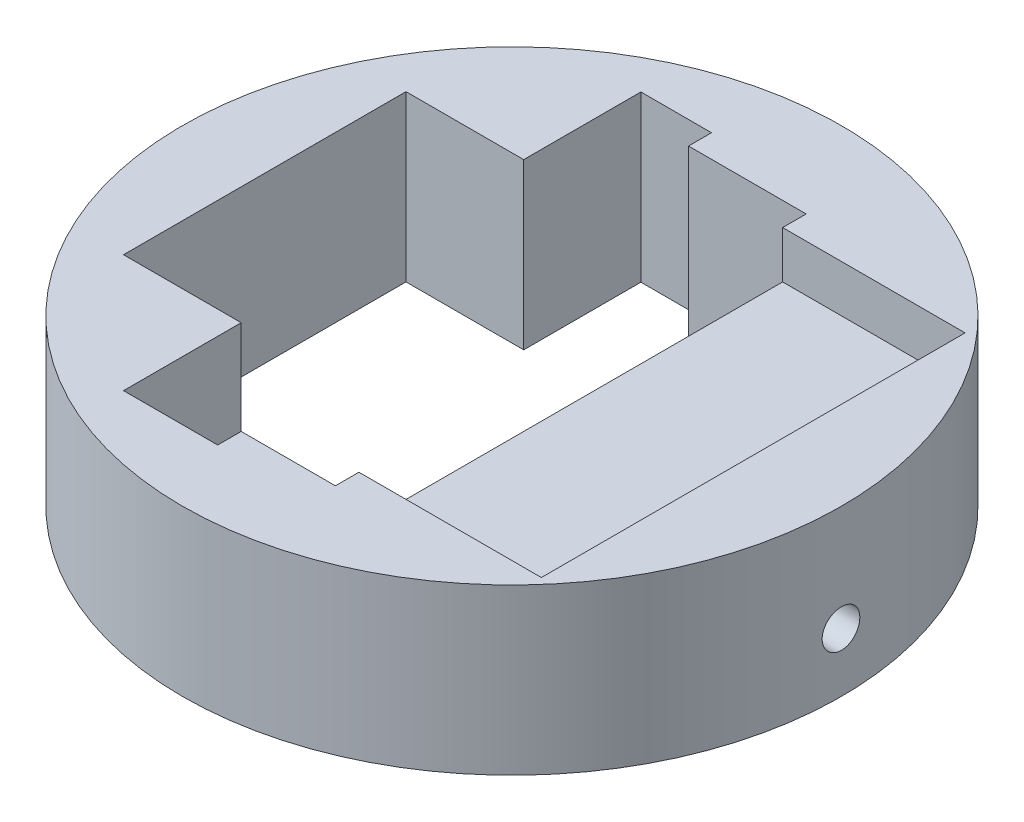
ISO-10303-21;
HEADER;
FILE_DESCRIPTION(('STEP AP214'),'2;1');
FILE_NAME('part.step','',(''),(''),'','','');
FILE_SCHEMA(('AUTOMOTIVE_DESIGN { 1 0 10303 214 1 1 1 1 }'));
ENDSEC;
DATA;
#1=APPLICATION_CONTEXT('core data for automotive mechanical design processes');
#2=APPLICATION_PROTOCOL_DEFINITION('international standard','automotive_design',2000,#1);
#3=PRODUCT_CONTEXT('',#1,'mechanical');
#4=PRODUCT('Part','Part','',(#3));
#5=PRODUCT_RELATED_PRODUCT_CATEGORY('part','',(#4));
#6=PRODUCT_DEFINITION_FORMATION('','',#4);
#7=PRODUCT_DEFINITION_CONTEXT('part definition',#1,'design');
#8=PRODUCT_DEFINITION('design','',#6,#7);
#9=PRODUCT_DEFINITION_SHAPE('','',#8);
#10=(LENGTH_UNIT() NAMED_UNIT(*) SI_UNIT(.MILLI.,.METRE.));
#11=(NAMED_UNIT(*) PLANE_ANGLE_UNIT() SI_UNIT($,.RADIAN.));
#12=(NAMED_UNIT(*) SI_UNIT($,.STERADIAN.) SOLID_ANGLE_UNIT());
#13=UNCERTAINTY_MEASURE_WITH_UNIT(LENGTH_MEASURE(1.E-05),#10,'distance_accuracy_value','');
#14=(GEOMETRIC_REPRESENTATION_CONTEXT(3) GLOBAL_UNCERTAINTY_ASSIGNED_CONTEXT((#13)) GLOBAL_UNIT_ASSIGNED_CONTEXT((#10,
#11,#12)) REPRESENTATION_CONTEXT('',''));
#15=CARTESIAN_POINT('',(0.,0.,0.));
#16=DIRECTION('',(0.,0.,1.));
#17=DIRECTION('',(1.,0.,0.));
#18=AXIS2_PLACEMENT_3D('',#15,#16,#17);
#19=CARTESIAN_POINT('',(0.,7.,0.));
#20=DIRECTION('',(0.,-1.,0.));
#21=DIRECTION('',(0.,0.,-1.));
#22=AXIS2_PLACEMENT_3D('',#19,#20,#21);
#23=CYLINDRICAL_SURFACE('',#22,14.);
#24=CARTESIAN_POINT('',(13.9771241677249,2.5,-0.8));
#25=CARTESIAN_POINT('',(13.9771244743379,2.45510302465943,-0.799998021692271));
#26=CARTESIAN_POINT('',(13.9773428189584,2.41017442873324,-0.796207792688452));
#27=CARTESIAN_POINT('',(13.9781927308026,2.3215572958776,-0.781141927639512));
#28=CARTESIAN_POINT('',(13.9788247816795,2.27787027289035,-0.769857530128635));
#29=CARTESIAN_POINT('',(13.9804302796029,2.1930327775627,-0.740128039150316));
#30=CARTESIAN_POINT('',(13.9814035492303,2.1518810000528,-0.721686666469071));
#31=CARTESIAN_POINT('',(13.9835815940789,2.07326800516524,-0.678172589252471));
#32=CARTESIAN_POINT('',(13.984786315527,2.03580593361201,-0.653101424505277));
#33=CARTESIAN_POINT('',(13.9872932684381,1.96557689336275,-0.597004068657194));
#34=CARTESIAN_POINT('',(13.9885956080889,1.93281525477298,-0.565971209015206));
#35=CARTESIAN_POINT('',(13.9911500395831,1.87296261064955,-0.498844969154513));
#36=CARTESIAN_POINT('',(13.9924021293495,1.84587183932443,-0.462751380028906));
#37=CARTESIAN_POINT('',(13.9947158651488,1.79811428127445,-0.386499089336457));
#38=CARTESIAN_POINT('',(13.9957773835497,1.77745179304547,-0.346337691373904));
#39=CARTESIAN_POINT('',(13.9975892418334,1.74316488182172,-0.263108760186616));
#40=CARTESIAN_POINT('',(13.9983395846018,1.72954039355904,-0.220041253916278));
#41=CARTESIAN_POINT('',(13.9994438040274,1.70973071440032,-0.132272992202261));
#42=CARTESIAN_POINT('',(13.9997981170164,1.70353733561141,-0.087574090377647));
#43=CARTESIAN_POINT('',(14.0000718187461,1.69874040454522,0.00223019544865451));
#44=CARTESIAN_POINT('',(13.999991211715,1.70013677848075,0.0473355754943249));
#45=CARTESIAN_POINT('',(13.9994045220293,1.71047294338269,0.136616990257277));
#46=CARTESIAN_POINT('',(13.9988989362861,1.71940392446052,0.180794048618258));
#47=CARTESIAN_POINT('',(13.9975197945313,1.74454212108032,0.267020923206767));
#48=CARTESIAN_POINT('',(13.996646236631,1.76074937396427,0.309070728515957));
#49=CARTESIAN_POINT('',(13.9946286715729,1.79999005735905,0.389877779004846));
#50=CARTESIAN_POINT('',(13.9934845059263,1.823027490159,0.428633076517221));
#51=CARTESIAN_POINT('',(13.9910545304804,1.87527166896045,0.501729713394125));
#52=CARTESIAN_POINT('',(13.9897687193576,1.90447847260603,0.536071011511226));
#53=CARTESIAN_POINT('',(13.987198034341,1.96828209735191,0.599416228139994));
#54=CARTESIAN_POINT('',(13.9859131644143,2.00288656355519,0.628412446941761));
#55=CARTESIAN_POINT('',(13.9834910578935,2.07647640218527,0.6801850661041));
#56=CARTESIAN_POINT('',(13.9823538213484,2.11546177606919,0.702961464395896));
#57=CARTESIAN_POINT('',(13.9803553735595,2.19671156057994,0.741647299659374));
#58=CARTESIAN_POINT('',(13.979494174715,2.2389761184002,0.757556428167799));
#59=CARTESIAN_POINT('',(13.978145377356,2.32558235792233,0.782050885226867));
#60=CARTESIAN_POINT('',(13.9776577751701,2.36992401920848,0.790636285745998));
#61=CARTESIAN_POINT('',(13.9771118429597,2.45935864688665,0.800230017849172));
#62=CARTESIAN_POINT('',(13.9770529069843,2.50445046240984,0.8012490450961));
#63=CARTESIAN_POINT('',(13.97736937101,2.59416441038649,0.79570903414815));
#64=CARTESIAN_POINT('',(13.9777447691271,2.6387865448766,0.789150028827261));
#65=CARTESIAN_POINT('',(13.978887040407,2.72626431891299,0.768649017165485));
#66=CARTESIAN_POINT('',(13.9796536531,2.76912111332669,0.754711922906852));
#67=CARTESIAN_POINT('',(13.9814917351046,2.85188727449899,0.719855329628873));
#68=CARTESIAN_POINT('',(13.9825632067261,2.89179661892156,0.69893577770247));
#69=CARTESIAN_POINT('',(13.9848917244275,2.96758416564593,0.650680712140984));
#70=CARTESIAN_POINT('',(13.986148977444,3.00345779317197,0.623338023669904));
#71=CARTESIAN_POINT('',(13.9887066397301,3.07010953130303,0.563023304012391));
#72=CARTESIAN_POINT('',(13.9900070493554,3.10088759991509,0.53005122643821));
#73=CARTESIAN_POINT('',(13.992506243677,3.15651058730901,0.459367694647848));
#74=CARTESIAN_POINT('',(13.9937049088842,3.18134859057582,0.421650793609244));
#75=CARTESIAN_POINT('',(13.9958638239064,3.22433908700389,0.34257571280156));
#76=CARTESIAN_POINT('',(13.9968240749955,3.24249161589185,0.301217552492577));
#77=CARTESIAN_POINT('',(13.9983973821016,3.27158382151925,0.216059520846397));
#78=CARTESIAN_POINT('',(13.9990106498015,3.28252789656211,0.172261156150845));
#79=CARTESIAN_POINT('',(13.9998217253799,3.29690693064926,0.0834449771201405));
#80=CARTESIAN_POINT('',(14.000019536551,3.30034194920375,0.0384271724520609));
#81=CARTESIAN_POINT('',(13.9999774203995,3.29960479661445,-0.0514814660033658));
#82=CARTESIAN_POINT('',(13.9997381164755,3.29544345913994,-0.0963723893098683));
#83=CARTESIAN_POINT('',(13.9988499280013,3.27965415187652,-0.184817076656193));
#84=CARTESIAN_POINT('',(13.9982010427057,3.268026168498,-0.228370838262177));
#85=CARTESIAN_POINT('',(13.9965666569387,3.23763599714559,-0.312906764220562));
#86=CARTESIAN_POINT('',(13.9955811563998,3.21887380774221,-0.353888928057685));
#87=CARTESIAN_POINT('',(13.9933842728574,3.17474945527508,-0.432122649960499));
#88=CARTESIAN_POINT('',(13.992172896202,3.14938747768431,-0.469374312823235));
#89=CARTESIAN_POINT('',(13.9896585364474,3.0927438844043,-0.539144245777155));
#90=CARTESIAN_POINT('',(13.9883554351211,3.06145453754417,-0.571656234714201));
#91=CARTESIAN_POINT('',(13.9858053881471,2.99385288901703,-0.630976807993079));
#92=CARTESIAN_POINT('',(13.984558456354,2.95753935700353,-0.657783991221041));
#93=CARTESIAN_POINT('',(13.9822603594601,2.8808845668857,-0.704950512737781));
#94=CARTESIAN_POINT('',(13.9812094136072,2.84053887458843,-0.725302647438153));
#95=CARTESIAN_POINT('',(13.9794251418201,2.75702680367127,-0.758919461317532));
#96=CARTESIAN_POINT('',(13.9786914426304,2.71386380896594,-0.772192473731904));
#97=CARTESIAN_POINT('',(13.9778177733066,2.64202904603279,-0.787809986450049));
#98=CARTESIAN_POINT('',(13.9775588265759,2.61382206100608,-0.792375364590585));
#99=CARTESIAN_POINT('',(13.9772119264058,2.55708097826925,-0.798470998565349));
#100=CARTESIAN_POINT('',(13.9771239727709,2.52854688093308,-0.800001257869039));
#101=CARTESIAN_POINT('',(13.9771241677249,2.5,-0.8));
#102=B_SPLINE_CURVE_WITH_KNOTS('',3,(#24,#25,#26,#27,#28,#29,#30,#31,#32,#33,#34,#35,#36,#37,
#38,#39,#40,#41,#42,#43,#44,#45,#46,#47,#48,#49,#50,#51,#52,#53,#54,#55,#56,#57,#58,#59,#60,#61,
#62,#63,#64,#65,#66,#67,#68,#69,#70,#71,#72,#73,#74,#75,#76,#77,#78,#79,#80,#81,#82,#83,#84,#85,
#86,#87,#88,#89,#90,#91,#92,#93,#94,#95,#96,#97,#98,#99,#100,#101),.UNSPECIFIED.,.T.,.F.,(4,2,2,
2,2,2,2,2,2,2,2,2,2,2,2,2,2,2,2,2,2,2,2,2,2,2,2,2,2,2,2,2,2,2,2,2,2,2,4),(0.,0.134586715237445,
0.269331054045677,0.404005435266397,0.538648565406722,0.673443188862089,0.808243378278339,
0.943133513762434,1.07802239830123,1.21276251999767,1.34750133175979,1.48208281728607,
1.61666499349512,1.75132618738098,1.88598863954166,2.02084358549235,2.15569857629709,
2.29055962387305,2.42541934618712,2.56008839733374,2.69475686427961,2.82933578605909,
2.96391572758501,3.09864671983372,3.23337882235727,3.36826702667495,3.50315451014905,
3.63795961437256,3.77276365024519,3.90737558328355,4.04198776132165,4.17659996633228,
4.31120838876229,4.44599360746087,4.58081189162265,4.71578010276107,4.85058908254449,
4.9361635627354,5.02173794510557),.UNSPECIFIED.);
#103=CARTESIAN_POINT('',(13.9771241677249,2.5,-0.8));
#104=VERTEX_POINT('',#103);
#105=EDGE_CURVE('E171',#104,#104,#102,.T.);
#106=ORIENTED_EDGE('',*,*,#105,.T.);
#107=EDGE_LOOP('',(#106));
#108=FACE_BOUND('',#107,.T.);
#109=CARTESIAN_POINT('',(0.,7.,0.));
#110=DIRECTION('',(0.,1.,0.));
#111=DIRECTION('',(0.,0.,1.));
#112=AXIS2_PLACEMENT_3D('',#109,#110,#111);
#113=CIRCLE('',#112,14.);
#114=CARTESIAN_POINT('',(0.,7.,14.));
#115=VERTEX_POINT('',#114);
#116=EDGE_CURVE('E279',#115,#115,#113,.T.);
#117=ORIENTED_EDGE('',*,*,#116,.F.);
#118=EDGE_LOOP('',(#117));
#119=FACE_BOUND('',#118,.T.);
#120=CARTESIAN_POINT('',(0.,0.,0.));
#121=DIRECTION('',(0.,1.,0.));
#122=DIRECTION('',(0.,0.,1.));
#123=AXIS2_PLACEMENT_3D('',#120,#121,#122);
#124=CIRCLE('',#123,14.);
#125=CARTESIAN_POINT('',(0.,0.,14.));
#126=VERTEX_POINT('',#125);
#127=EDGE_CURVE('E256',#126,#126,#124,.T.);
#128=ORIENTED_EDGE('',*,*,#127,.T.);
#129=EDGE_LOOP('',(#128));
#130=FACE_BOUND('',#129,.T.);
#131=ADVANCED_FACE('F34',(#108,#119,#130),#23,.T.);
#132=CARTESIAN_POINT('',(0.,7.,0.));
#133=DIRECTION('',(0.,1.,0.));
#134=DIRECTION('',(0.,0.,1.));
#135=AXIS2_PLACEMENT_3D('',#132,#133,#134);
#136=PLANE('',#135);
#137=DIRECTION('',(1.,0.,0.));
#138=VECTOR('',#137,1.);
#139=CARTESIAN_POINT('',(-1.75,7.,9.));
#140=LINE('',#139,#138);
#141=CARTESIAN_POINT('',(2.50000000000001,7.,9.));
#142=VERTEX_POINT('',#141);
#143=CARTESIAN_POINT('',(10.25,7.,9.));
#144=VERTEX_POINT('',#143);
#145=EDGE_CURVE('E166',#142,#144,#140,.T.);
#146=ORIENTED_EDGE('',*,*,#145,.F.);
#147=DIRECTION('',(0.,0.,-1.));
#148=VECTOR('',#147,1.);
#149=CARTESIAN_POINT('',(2.50000000000001,7.,10.));
#150=LINE('',#149,#148);
#151=CARTESIAN_POINT('',(2.50000000000001,7.,10.));
#152=VERTEX_POINT('',#151);
#153=EDGE_CURVE('E243',#152,#142,#150,.T.);
#154=ORIENTED_EDGE('',*,*,#153,.F.);
#155=DIRECTION('',(1.,0.,0.));
#156=VECTOR('',#155,1.);
#157=CARTESIAN_POINT('',(2.50000000000001,7.,10.));
#158=LINE('',#157,#156);
#159=CARTESIAN_POINT('',(-1.5,7.,10.));
#160=VERTEX_POINT('',#159);
#161=EDGE_CURVE('E239',#160,#152,#158,.T.);
#162=ORIENTED_EDGE('',*,*,#161,.F.);
#163=DIRECTION('',(0.,0.,-1.));
#164=VECTOR('',#163,1.);
#165=CARTESIAN_POINT('',(-1.5,7.,11.));
#166=LINE('',#165,#164);
#167=CARTESIAN_POINT('',(-1.5,7.,11.));
#168=VERTEX_POINT('',#167);
#169=EDGE_CURVE('E236',#168,#160,#166,.T.);
#170=ORIENTED_EDGE('',*,*,#169,.F.);
#171=DIRECTION('',(1.,0.,0.));
#172=VECTOR('',#171,1.);
#173=CARTESIAN_POINT('',(-5.5,7.,11.));
#174=LINE('',#173,#172);
#175=CARTESIAN_POINT('',(-5.5,7.,11.));
#176=VERTEX_POINT('',#175);
#177=EDGE_CURVE('E233',#176,#168,#174,.T.);
#178=ORIENTED_EDGE('',*,*,#177,.F.);
#179=DIRECTION('',(0.,0.,1.));
#180=VECTOR('',#179,1.);
#181=CARTESIAN_POINT('',(-5.5,7.,11.));
#182=LINE('',#181,#180);
#183=CARTESIAN_POINT('',(-5.5,7.,6.));
#184=VERTEX_POINT('',#183);
#185=EDGE_CURVE('E230',#184,#176,#182,.T.);
#186=ORIENTED_EDGE('',*,*,#185,.F.);
#187=DIRECTION('',(1.,0.,0.));
#188=VECTOR('',#187,1.);
#189=CARTESIAN_POINT('',(-5.5,7.,6.));
#190=LINE('',#189,#188);
#191=CARTESIAN_POINT('',(-10.5,7.,6.));
#192=VERTEX_POINT('',#191);
#193=EDGE_CURVE('E227',#192,#184,#190,.T.);
#194=ORIENTED_EDGE('',*,*,#193,.F.);
#195=DIRECTION('',(0.,0.,1.));
#196=VECTOR('',#195,1.);
#197=CARTESIAN_POINT('',(-10.5,7.,-6.));
#198=LINE('',#197,#196);
#199=CARTESIAN_POINT('',(-10.5,7.,-6.));
#200=VERTEX_POINT('',#199);
#201=EDGE_CURVE('E224',#200,#192,#198,.T.);
#202=ORIENTED_EDGE('',*,*,#201,.F.);
#203=DIRECTION('',(-1.,0.,0.));
#204=VECTOR('',#203,1.);
#205=CARTESIAN_POINT('',(-5.5,7.,-6.));
#206=LINE('',#205,#204);
#207=CARTESIAN_POINT('',(-5.5,7.,-6.));
#208=VERTEX_POINT('',#207);
#209=EDGE_CURVE('E221',#208,#200,#206,.T.);
#210=ORIENTED_EDGE('',*,*,#209,.F.);
#211=DIRECTION('',(0.,0.,1.));
#212=VECTOR('',#211,1.);
#213=CARTESIAN_POINT('',(-5.5,7.,-10.9772609758359));
#214=LINE('',#213,#212);
#215=CARTESIAN_POINT('',(-5.5,7.,-10.9772609758359));
#216=VERTEX_POINT('',#215);
#217=EDGE_CURVE('E57',#216,#208,#214,.T.);
#218=ORIENTED_EDGE('',*,*,#217,.F.);
#219=DIRECTION('',(-1.,0.,0.));
#220=VECTOR('',#219,1.);
#221=CARTESIAN_POINT('',(-5.5,7.,-10.9772609758359));
#222=LINE('',#221,#220);
#223=CARTESIAN_POINT('',(-2.5,7.,-10.9772609758359));
#224=VERTEX_POINT('',#223);
#225=EDGE_CURVE('E186',#224,#216,#222,.T.);
#226=ORIENTED_EDGE('',*,*,#225,.F.);
#227=DIRECTION('',(0.,0.,-1.));
#228=VECTOR('',#227,1.);
#229=CARTESIAN_POINT('',(-2.5,7.,-10.9772609758359));
#230=LINE('',#229,#228);
#231=CARTESIAN_POINT('',(-2.49999999999999,7.,-10.));
#232=VERTEX_POINT('',#231);
#233=EDGE_CURVE('E249',#232,#224,#230,.T.);
#234=ORIENTED_EDGE('',*,*,#233,.F.);
#235=DIRECTION('',(-1.,0.,0.));
#236=VECTOR('',#235,1.);
#237=CARTESIAN_POINT('',(2.50000000000001,7.,-10.));
#238=LINE('',#237,#236);
#239=CARTESIAN_POINT('',(2.50000000000001,7.,-10.));
#240=VERTEX_POINT('',#239);
#241=EDGE_CURVE('E246',#240,#232,#238,.T.);
#242=ORIENTED_EDGE('',*,*,#241,.F.);
#243=CARTESIAN_POINT('',(2.50000000000001,7.,-9.));
#244=VERTEX_POINT('',#243);
#245=EDGE_CURVE('E242',#244,#240,#150,.T.);
#246=ORIENTED_EDGE('',*,*,#245,.F.);
#247=DIRECTION('',(-1.,0.,0.));
#248=VECTOR('',#247,1.);
#249=CARTESIAN_POINT('',(-1.75,7.,-9.));
#250=LINE('',#249,#248);
#251=CARTESIAN_POINT('',(10.25,7.,-9.));
#252=VERTEX_POINT('',#251);
#253=EDGE_CURVE('E168',#252,#244,#250,.T.);
#254=ORIENTED_EDGE('',*,*,#253,.F.);
#255=DIRECTION('',(0.,0.,-1.));
#256=VECTOR('',#255,1.);
#257=CARTESIAN_POINT('',(10.25,7.,9.));
#258=LINE('',#257,#256);
#259=EDGE_CURVE('E153',#144,#252,#258,.T.);
#260=ORIENTED_EDGE('',*,*,#259,.F.);
#261=EDGE_LOOP('',(#146,#154,#162,#170,#178,#186,#194,#202,#210,#218,#226,#234,#242,#246,#254,#260));
#262=FACE_BOUND('',#261,.T.);
#263=ORIENTED_EDGE('',*,*,#116,.T.);
#264=EDGE_LOOP('',(#263));
#265=FACE_BOUND('',#264,.T.);
#266=ADVANCED_FACE('F291',(#262,#265),#136,.T.);
#267=CARTESIAN_POINT('',(0.,0.,0.));
#268=DIRECTION('',(0.,1.,0.));
#269=DIRECTION('',(0.,0.,1.));
#270=AXIS2_PLACEMENT_3D('',#267,#268,#269);
#271=PLANE('',#270);
#272=DIRECTION('',(-1.,0.,0.));
#273=VECTOR('',#272,1.);
#274=CARTESIAN_POINT('',(-5.5,0.,-10.9772609758359));
#275=LINE('',#274,#273);
#276=CARTESIAN_POINT('',(-2.5,0.,-10.9772609758359));
#277=VERTEX_POINT('',#276);
#278=CARTESIAN_POINT('',(-5.5,0.,-10.9772609758359));
#279=VERTEX_POINT('',#278);
#280=EDGE_CURVE('E216',#277,#279,#275,.T.);
#281=ORIENTED_EDGE('',*,*,#280,.T.);
#282=DIRECTION('',(0.,0.,1.));
#283=VECTOR('',#282,1.);
#284=CARTESIAN_POINT('',(-5.5,0.,-10.9772609758359));
#285=LINE('',#284,#283);
#286=CARTESIAN_POINT('',(-5.5,0.,-6.));
#287=VERTEX_POINT('',#286);
#288=EDGE_CURVE('E182',#279,#287,#285,.T.);
#289=ORIENTED_EDGE('',*,*,#288,.T.);
#290=DIRECTION('',(-1.,0.,0.));
#291=VECTOR('',#290,1.);
#292=CARTESIAN_POINT('',(-5.5,0.,-6.));
#293=LINE('',#292,#291);
#294=CARTESIAN_POINT('',(-10.5,0.,-6.));
#295=VERTEX_POINT('',#294);
#296=EDGE_CURVE('E185',#287,#295,#293,.T.);
#297=ORIENTED_EDGE('',*,*,#296,.T.);
#298=DIRECTION('',(0.,0.,1.));
#299=VECTOR('',#298,1.);
#300=CARTESIAN_POINT('',(-10.5,0.,-6.));
#301=LINE('',#300,#299);
#302=CARTESIAN_POINT('',(-10.5,0.,6.));
#303=VERTEX_POINT('',#302);
#304=EDGE_CURVE('E189',#295,#303,#301,.T.);
#305=ORIENTED_EDGE('',*,*,#304,.T.);
#306=DIRECTION('',(1.,0.,0.));
#307=VECTOR('',#306,1.);
#308=CARTESIAN_POINT('',(-5.5,0.,6.));
#309=LINE('',#308,#307);
#310=CARTESIAN_POINT('',(-5.5,0.,6.));
#311=VERTEX_POINT('',#310);
#312=EDGE_CURVE('E192',#303,#311,#309,.T.);
#313=ORIENTED_EDGE('',*,*,#312,.T.);
#314=DIRECTION('',(0.,0.,1.));
#315=VECTOR('',#314,1.);
#316=CARTESIAN_POINT('',(-5.5,0.,11.));
#317=LINE('',#316,#315);
#318=CARTESIAN_POINT('',(-5.5,0.,11.));
#319=VERTEX_POINT('',#318);
#320=EDGE_CURVE('E195',#311,#319,#317,.T.);
#321=ORIENTED_EDGE('',*,*,#320,.T.);
#322=DIRECTION('',(1.,0.,0.));
#323=VECTOR('',#322,1.);
#324=CARTESIAN_POINT('',(-5.5,0.,11.));
#325=LINE('',#324,#323);
#326=CARTESIAN_POINT('',(-1.5,0.,11.));
#327=VERTEX_POINT('',#326);
#328=EDGE_CURVE('E198',#319,#327,#325,.T.);
#329=ORIENTED_EDGE('',*,*,#328,.T.);
#330=DIRECTION('',(0.,0.,-1.));
#331=VECTOR('',#330,1.);
#332=CARTESIAN_POINT('',(-1.5,0.,11.));
#333=LINE('',#332,#331);
#334=CARTESIAN_POINT('',(-1.5,0.,10.));
#335=VERTEX_POINT('',#334);
#336=EDGE_CURVE('E201',#327,#335,#333,.T.);
#337=ORIENTED_EDGE('',*,*,#336,.T.);
#338=DIRECTION('',(1.,0.,0.));
#339=VECTOR('',#338,1.);
#340=CARTESIAN_POINT('',(2.50000000000001,0.,10.));
#341=LINE('',#340,#339);
#342=CARTESIAN_POINT('',(2.50000000000001,0.,10.));
#343=VERTEX_POINT('',#342);
#344=EDGE_CURVE('E204',#335,#343,#341,.T.);
#345=ORIENTED_EDGE('',*,*,#344,.T.);
#346=DIRECTION('',(0.,0.,-1.));
#347=VECTOR('',#346,1.);
#348=CARTESIAN_POINT('',(2.50000000000001,0.,10.));
#349=LINE('',#348,#347);
#350=CARTESIAN_POINT('',(2.50000000000001,0.,-10.));
#351=VERTEX_POINT('',#350);
#352=EDGE_CURVE('E207',#343,#351,#349,.T.);
#353=ORIENTED_EDGE('',*,*,#352,.T.);
#354=DIRECTION('',(-1.,0.,0.));
#355=VECTOR('',#354,1.);
#356=CARTESIAN_POINT('',(2.50000000000001,0.,-10.));
#357=LINE('',#356,#355);
#358=CARTESIAN_POINT('',(-2.49999999999999,0.,-10.));
#359=VERTEX_POINT('',#358);
#360=EDGE_CURVE('E210',#351,#359,#357,.T.);
#361=ORIENTED_EDGE('',*,*,#360,.T.);
#362=DIRECTION('',(0.,0.,-1.));
#363=VECTOR('',#362,1.);
#364=CARTESIAN_POINT('',(-2.5,0.,-10.9772609758359));
#365=LINE('',#364,#363);
#366=EDGE_CURVE('E213',#359,#277,#365,.T.);
#367=ORIENTED_EDGE('',*,*,#366,.T.);
#368=EDGE_LOOP('',(#281,#289,#297,#305,#313,#321,#329,#337,#345,#353,#361,#367));
#369=FACE_BOUND('',#368,.T.);
#370=ORIENTED_EDGE('',*,*,#127,.F.);
#371=EDGE_LOOP('',(#370));
#372=FACE_BOUND('',#371,.T.);
#373=ADVANCED_FACE('F302',(#369,#372),#271,.F.);
#374=CARTESIAN_POINT('',(-5.5,0.,-10.9772609758359));
#375=DIRECTION('',(-1.,0.,0.));
#376=DIRECTION('',(0.,0.,1.));
#377=AXIS2_PLACEMENT_3D('',#374,#375,#376);
#378=PLANE('',#377);
#379=ORIENTED_EDGE('',*,*,#217,.T.);
#380=DIRECTION('',(0.,1.,0.));
#381=VECTOR('',#380,1.);
#382=CARTESIAN_POINT('',(-5.5,0.,-6.));
#383=LINE('',#382,#381);
#384=EDGE_CURVE('E219',#287,#208,#383,.T.);
#385=ORIENTED_EDGE('',*,*,#384,.F.);
#386=ORIENTED_EDGE('',*,*,#288,.F.);
#387=DIRECTION('',(0.,1.,0.));
#388=VECTOR('',#387,1.);
#389=CARTESIAN_POINT('',(-5.5,0.,-10.9772609758359));
#390=LINE('',#389,#388);
#391=EDGE_CURVE('E254',#279,#216,#390,.T.);
#392=ORIENTED_EDGE('',*,*,#391,.T.);
#393=EDGE_LOOP('',(#379,#385,#386,#392));
#394=FACE_BOUND('',#393,.T.);
#395=ADVANCED_FACE('F337',(#394),#378,.F.);
#396=CARTESIAN_POINT('',(-5.5,0.,-10.9772609758359));
#397=DIRECTION('',(0.,0.,-1.));
#398=DIRECTION('',(-1.,0.,0.));
#399=AXIS2_PLACEMENT_3D('',#396,#397,#398);
#400=PLANE('',#399);
#401=ORIENTED_EDGE('',*,*,#225,.T.);
#402=ORIENTED_EDGE('',*,*,#391,.F.);
#403=ORIENTED_EDGE('',*,*,#280,.F.);
#404=DIRECTION('',(0.,1.,0.));
#405=VECTOR('',#404,1.);
#406=CARTESIAN_POINT('',(-2.5,0.,-10.9772609758359));
#407=LINE('',#406,#405);
#408=EDGE_CURVE('E257',#277,#224,#407,.T.);
#409=ORIENTED_EDGE('',*,*,#408,.T.);
#410=EDGE_LOOP('',(#401,#402,#403,#409));
#411=FACE_BOUND('',#410,.T.);
#412=ADVANCED_FACE('F341',(#411),#400,.F.);
#413=CARTESIAN_POINT('',(-2.5,0.,-10.9772609758359));
#414=DIRECTION('',(1.,0.,0.));
#415=DIRECTION('',(0.,0.,-1.));
#416=AXIS2_PLACEMENT_3D('',#413,#414,#415);
#417=PLANE('',#416);
#418=ORIENTED_EDGE('',*,*,#233,.T.);
#419=ORIENTED_EDGE('',*,*,#408,.F.);
#420=ORIENTED_EDGE('',*,*,#366,.F.);
#421=DIRECTION('',(0.,1.,0.));
#422=VECTOR('',#421,1.);
#423=CARTESIAN_POINT('',(-2.49999999999999,0.,-10.));
#424=LINE('',#423,#422);
#425=EDGE_CURVE('E259',#359,#232,#424,.T.);
#426=ORIENTED_EDGE('',*,*,#425,.T.);
#427=EDGE_LOOP('',(#418,#419,#420,#426));
#428=FACE_BOUND('',#427,.T.);
#429=ADVANCED_FACE('F370',(#428),#417,.F.);
#430=CARTESIAN_POINT('',(2.50000000000001,0.,-10.));
#431=DIRECTION('',(0.,0.,-1.));
#432=DIRECTION('',(-1.,0.,0.));
#433=AXIS2_PLACEMENT_3D('',#430,#431,#432);
#434=PLANE('',#433);
#435=ORIENTED_EDGE('',*,*,#241,.T.);
#436=ORIENTED_EDGE('',*,*,#425,.F.);
#437=ORIENTED_EDGE('',*,*,#360,.F.);
#438=DIRECTION('',(0.,1.,0.));
#439=VECTOR('',#438,1.);
#440=CARTESIAN_POINT('',(2.50000000000001,0.,-10.));
#441=LINE('',#440,#439);
#442=EDGE_CURVE('E261',#351,#240,#441,.T.);
#443=ORIENTED_EDGE('',*,*,#442,.T.);
#444=EDGE_LOOP('',(#435,#436,#437,#443));
#445=FACE_BOUND('',#444,.T.);
#446=ADVANCED_FACE('F296',(#445),#434,.F.);
#447=CARTESIAN_POINT('',(2.50000000000001,0.,10.));
#448=DIRECTION('',(1.,0.,0.));
#449=DIRECTION('',(0.,0.,-1.));
#450=AXIS2_PLACEMENT_3D('',#447,#448,#449);
#451=PLANE('',#450);
#452=CARTESIAN_POINT('',(2.50000000000001,2.5,0.));
#453=DIRECTION('',(1.,0.,0.));
#454=DIRECTION('',(0.,0.,-1.));
#455=AXIS2_PLACEMENT_3D('',#452,#453,#454);
#456=CIRCLE('',#455,0.8);
#457=CARTESIAN_POINT('',(2.50000000000001,2.5,-0.8));
#458=VERTEX_POINT('',#457);
#459=EDGE_CURVE('E500',#458,#458,#456,.F.);
#460=ORIENTED_EDGE('',*,*,#459,.F.);
#461=EDGE_LOOP('',(#460));
#462=FACE_BOUND('',#461,.T.);
#463=ORIENTED_EDGE('',*,*,#153,.T.);
#464=DIRECTION('',(0.,-1.,0.));
#465=VECTOR('',#464,1.);
#466=CARTESIAN_POINT('',(2.50000000000001,0.,9.));
#467=LINE('',#466,#465);
#468=CARTESIAN_POINT('',(2.50000000000001,5.,9.));
#469=VERTEX_POINT('',#468);
#470=EDGE_CURVE('E11',#142,#469,#467,.T.);
#471=ORIENTED_EDGE('',*,*,#470,.T.);
#472=DIRECTION('',(0.,0.,-1.));
#473=VECTOR('',#472,1.);
#474=CARTESIAN_POINT('',(2.50000000000001,5.,10.));
#475=LINE('',#474,#473);
#476=CARTESIAN_POINT('',(2.50000000000001,5.,-9.));
#477=VERTEX_POINT('',#476);
#478=EDGE_CURVE('E282',#469,#477,#475,.T.);
#479=ORIENTED_EDGE('',*,*,#478,.T.);
#480=DIRECTION('',(0.,1.,0.));
#481=VECTOR('',#480,1.);
#482=CARTESIAN_POINT('',(2.50000000000001,0.,-9.));
#483=LINE('',#482,#481);
#484=EDGE_CURVE('E42',#477,#244,#483,.T.);
#485=ORIENTED_EDGE('',*,*,#484,.T.);
#486=ORIENTED_EDGE('',*,*,#245,.T.);
#487=ORIENTED_EDGE('',*,*,#442,.F.);
#488=ORIENTED_EDGE('',*,*,#352,.F.);
#489=DIRECTION('',(0.,1.,0.));
#490=VECTOR('',#489,1.);
#491=CARTESIAN_POINT('',(2.50000000000001,0.,10.));
#492=LINE('',#491,#490);
#493=EDGE_CURVE('E264',#343,#152,#492,.T.);
#494=ORIENTED_EDGE('',*,*,#493,.T.);
#495=EDGE_LOOP('',(#463,#471,#479,#485,#486,#487,#488,#494));
#496=FACE_BOUND('',#495,.T.);
#497=ADVANCED_FACE('F287',(#462,#496),#451,.F.);
#498=CARTESIAN_POINT('',(2.50000000000001,0.,10.));
#499=DIRECTION('',(0.,0.,1.));
#500=DIRECTION('',(1.,0.,0.));
#501=AXIS2_PLACEMENT_3D('',#498,#499,#500);
#502=PLANE('',#501);
#503=ORIENTED_EDGE('',*,*,#161,.T.);
#504=ORIENTED_EDGE('',*,*,#493,.F.);
#505=ORIENTED_EDGE('',*,*,#344,.F.);
#506=DIRECTION('',(0.,1.,0.));
#507=VECTOR('',#506,1.);
#508=CARTESIAN_POINT('',(-1.5,0.,10.));
#509=LINE('',#508,#507);
#510=EDGE_CURVE('E266',#335,#160,#509,.T.);
#511=ORIENTED_EDGE('',*,*,#510,.T.);
#512=EDGE_LOOP('',(#503,#504,#505,#511));
#513=FACE_BOUND('',#512,.T.);
#514=ADVANCED_FACE('F306',(#513),#502,.F.);
#515=CARTESIAN_POINT('',(-1.5,0.,11.));
#516=DIRECTION('',(1.,0.,0.));
#517=DIRECTION('',(0.,0.,-1.));
#518=AXIS2_PLACEMENT_3D('',#515,#516,#517);
#519=PLANE('',#518);
#520=ORIENTED_EDGE('',*,*,#169,.T.);
#521=ORIENTED_EDGE('',*,*,#510,.F.);
#522=ORIENTED_EDGE('',*,*,#336,.F.);
#523=DIRECTION('',(0.,1.,0.));
#524=VECTOR('',#523,1.);
#525=CARTESIAN_POINT('',(-1.5,0.,11.));
#526=LINE('',#525,#524);
#527=EDGE_CURVE('E268',#327,#168,#526,.T.);
#528=ORIENTED_EDGE('',*,*,#527,.T.);
#529=EDGE_LOOP('',(#520,#521,#522,#528));
#530=FACE_BOUND('',#529,.T.);
#531=ADVANCED_FACE('F358',(#530),#519,.F.);
#532=CARTESIAN_POINT('',(-5.5,0.,11.));
#533=DIRECTION('',(0.,0.,1.));
#534=DIRECTION('',(1.,0.,0.));
#535=AXIS2_PLACEMENT_3D('',#532,#533,#534);
#536=PLANE('',#535);
#537=ORIENTED_EDGE('',*,*,#177,.T.);
#538=ORIENTED_EDGE('',*,*,#527,.F.);
#539=ORIENTED_EDGE('',*,*,#328,.F.);
#540=DIRECTION('',(0.,1.,0.));
#541=VECTOR('',#540,1.);
#542=CARTESIAN_POINT('',(-5.5,0.,11.));
#543=LINE('',#542,#541);
#544=EDGE_CURVE('E270',#319,#176,#543,.T.);
#545=ORIENTED_EDGE('',*,*,#544,.T.);
#546=EDGE_LOOP('',(#537,#538,#539,#545));
#547=FACE_BOUND('',#546,.T.);
#548=ADVANCED_FACE('F354',(#547),#536,.F.);
#549=CARTESIAN_POINT('',(-5.5,0.,11.));
#550=DIRECTION('',(-1.,0.,0.));
#551=DIRECTION('',(0.,0.,1.));
#552=AXIS2_PLACEMENT_3D('',#549,#550,#551);
#553=PLANE('',#552);
#554=ORIENTED_EDGE('',*,*,#185,.T.);
#555=ORIENTED_EDGE('',*,*,#544,.F.);
#556=ORIENTED_EDGE('',*,*,#320,.F.);
#557=DIRECTION('',(0.,1.,0.));
#558=VECTOR('',#557,1.);
#559=CARTESIAN_POINT('',(-5.5,0.,6.));
#560=LINE('',#559,#558);
#561=EDGE_CURVE('E272',#311,#184,#560,.T.);
#562=ORIENTED_EDGE('',*,*,#561,.T.);
#563=EDGE_LOOP('',(#554,#555,#556,#562));
#564=FACE_BOUND('',#563,.T.);
#565=ADVANCED_FACE('F350',(#564),#553,.F.);
#566=CARTESIAN_POINT('',(-5.5,0.,6.));
#567=DIRECTION('',(0.,0.,1.));
#568=DIRECTION('',(1.,0.,0.));
#569=AXIS2_PLACEMENT_3D('',#566,#567,#568);
#570=PLANE('',#569);
#571=ORIENTED_EDGE('',*,*,#193,.T.);
#572=ORIENTED_EDGE('',*,*,#561,.F.);
#573=ORIENTED_EDGE('',*,*,#312,.F.);
#574=DIRECTION('',(0.,1.,0.));
#575=VECTOR('',#574,1.);
#576=CARTESIAN_POINT('',(-10.5,0.,6.));
#577=LINE('',#576,#575);
#578=EDGE_CURVE('E274',#303,#192,#577,.T.);
#579=ORIENTED_EDGE('',*,*,#578,.T.);
#580=EDGE_LOOP('',(#571,#572,#573,#579));
#581=FACE_BOUND('',#580,.T.);
#582=ADVANCED_FACE('F346',(#581),#570,.F.);
#583=CARTESIAN_POINT('',(-10.5,0.,-6.));
#584=DIRECTION('',(-1.,0.,0.));
#585=DIRECTION('',(0.,0.,1.));
#586=AXIS2_PLACEMENT_3D('',#583,#584,#585);
#587=PLANE('',#586);
#588=ORIENTED_EDGE('',*,*,#201,.T.);
#589=ORIENTED_EDGE('',*,*,#578,.F.);
#590=ORIENTED_EDGE('',*,*,#304,.F.);
#591=DIRECTION('',(0.,1.,0.));
#592=VECTOR('',#591,1.);
#593=CARTESIAN_POINT('',(-10.5,0.,-6.));
#594=LINE('',#593,#592);
#595=EDGE_CURVE('E276',#295,#200,#594,.T.);
#596=ORIENTED_EDGE('',*,*,#595,.T.);
#597=EDGE_LOOP('',(#588,#589,#590,#596));
#598=FACE_BOUND('',#597,.T.);
#599=ADVANCED_FACE('F320',(#598),#587,.F.);
#600=CARTESIAN_POINT('',(-5.5,0.,-6.));
#601=DIRECTION('',(0.,0.,-1.));
#602=DIRECTION('',(-1.,0.,0.));
#603=AXIS2_PLACEMENT_3D('',#600,#601,#602);
#604=PLANE('',#603);
#605=ORIENTED_EDGE('',*,*,#209,.T.);
#606=ORIENTED_EDGE('',*,*,#595,.F.);
#607=ORIENTED_EDGE('',*,*,#296,.F.);
#608=ORIENTED_EDGE('',*,*,#384,.T.);
#609=EDGE_LOOP('',(#605,#606,#607,#608));
#610=FACE_BOUND('',#609,.T.);
#611=ADVANCED_FACE('F313',(#610),#604,.F.);
#612=CARTESIAN_POINT('',(-1.75,5.,9.));
#613=DIRECTION('',(0.,0.,1.));
#614=DIRECTION('',(1.,0.,0.));
#615=AXIS2_PLACEMENT_3D('',#612,#613,#614);
#616=PLANE('',#615);
#617=ORIENTED_EDGE('',*,*,#145,.T.);
#618=DIRECTION('',(0.,1.,0.));
#619=VECTOR('',#618,1.);
#620=CARTESIAN_POINT('',(10.25,5.,9.));
#621=LINE('',#620,#619);
#622=CARTESIAN_POINT('',(10.25,5.,9.));
#623=VERTEX_POINT('',#622);
#624=EDGE_CURVE('E156',#623,#144,#621,.T.);
#625=ORIENTED_EDGE('',*,*,#624,.F.);
#626=DIRECTION('',(1.,0.,0.));
#627=VECTOR('',#626,1.);
#628=CARTESIAN_POINT('',(-1.75,5.,9.));
#629=LINE('',#628,#627);
#630=EDGE_CURVE('E157',#469,#623,#629,.T.);
#631=ORIENTED_EDGE('',*,*,#630,.F.);
#632=ORIENTED_EDGE('',*,*,#470,.F.);
#633=EDGE_LOOP('',(#617,#625,#631,#632));
#634=FACE_BOUND('',#633,.T.);
#635=ADVANCED_FACE('F311',(#634),#616,.F.);
#636=CARTESIAN_POINT('',(-1.75,5.,-9.));
#637=DIRECTION('',(0.,0.,-1.));
#638=DIRECTION('',(-1.,0.,0.));
#639=AXIS2_PLACEMENT_3D('',#636,#637,#638);
#640=PLANE('',#639);
#641=DIRECTION('',(-1.,0.,0.));
#642=VECTOR('',#641,1.);
#643=CARTESIAN_POINT('',(-1.75,5.,-9.));
#644=LINE('',#643,#642);
#645=CARTESIAN_POINT('',(10.25,5.,-9.));
#646=VERTEX_POINT('',#645);
#647=EDGE_CURVE('E49',#646,#477,#644,.T.);
#648=ORIENTED_EDGE('',*,*,#647,.F.);
#649=DIRECTION('',(0.,1.,0.));
#650=VECTOR('',#649,1.);
#651=CARTESIAN_POINT('',(10.25,5.,-9.));
#652=LINE('',#651,#650);
#653=EDGE_CURVE('E148',#646,#252,#652,.T.);
#654=ORIENTED_EDGE('',*,*,#653,.T.);
#655=ORIENTED_EDGE('',*,*,#253,.T.);
#656=ORIENTED_EDGE('',*,*,#484,.F.);
#657=EDGE_LOOP('',(#648,#654,#655,#656));
#658=FACE_BOUND('',#657,.T.);
#659=ADVANCED_FACE('F159',(#658),#640,.F.);
#660=CARTESIAN_POINT('',(0.,5.,0.));
#661=DIRECTION('',(0.,-1.,0.));
#662=DIRECTION('',(0.,0.,-1.));
#663=AXIS2_PLACEMENT_3D('',#660,#661,#662);
#664=PLANE('',#663);
#665=ORIENTED_EDGE('',*,*,#630,.T.);
#666=DIRECTION('',(0.,0.,-1.));
#667=VECTOR('',#666,1.);
#668=CARTESIAN_POINT('',(10.25,5.,9.));
#669=LINE('',#668,#667);
#670=EDGE_CURVE('E151',#623,#646,#669,.T.);
#671=ORIENTED_EDGE('',*,*,#670,.T.);
#672=ORIENTED_EDGE('',*,*,#647,.T.);
#673=ORIENTED_EDGE('',*,*,#478,.F.);
#674=EDGE_LOOP('',(#665,#671,#672,#673));
#675=FACE_BOUND('',#674,.T.);
#676=ADVANCED_FACE('F163',(#675),#664,.F.);
#677=CARTESIAN_POINT('',(10.25,5.,9.));
#678=DIRECTION('',(1.,0.,0.));
#679=DIRECTION('',(0.,0.,-1.));
#680=AXIS2_PLACEMENT_3D('',#677,#678,#679);
#681=PLANE('',#680);
#682=ORIENTED_EDGE('',*,*,#259,.T.);
#683=ORIENTED_EDGE('',*,*,#653,.F.);
#684=ORIENTED_EDGE('',*,*,#670,.F.);
#685=ORIENTED_EDGE('',*,*,#624,.T.);
#686=EDGE_LOOP('',(#682,#683,#684,#685));
#687=FACE_BOUND('',#686,.T.);
#688=ADVANCED_FACE('F149',(#687),#681,.F.);
#689=CARTESIAN_POINT('',(0.237258300203054,2.5,0.));
#690=DIRECTION('',(1.,0.,0.));
#691=DIRECTION('',(0.,0.,-1.));
#692=AXIS2_PLACEMENT_3D('',#689,#690,#691);
#693=CYLINDRICAL_SURFACE('',#692,0.8);
#694=ORIENTED_EDGE('',*,*,#459,.T.);
#695=EDGE_LOOP('',(#694));
#696=FACE_BOUND('',#695,.T.);
#697=ORIENTED_EDGE('',*,*,#105,.F.);
#698=EDGE_LOOP('',(#697));
#699=FACE_BOUND('',#698,.T.);
#700=ADVANCED_FACE('F378',(#696,#699),#693,.F.);
#701=CLOSED_SHELL('',(#131,#266,#373,#395,#412,#429,#446,#497,#514,#531,#548,#565,#582,#599,
#611,#635,#659,#676,#688,#700));
#702=MANIFOLD_SOLID_BREP('B2',#701);
#703=ADVANCED_BREP_SHAPE_REPRESENTATION('',(#18,#702),#14);
#704=SHAPE_DEFINITION_REPRESENTATION(#9,#703);
ENDSEC;
END-ISO-10303-21;
